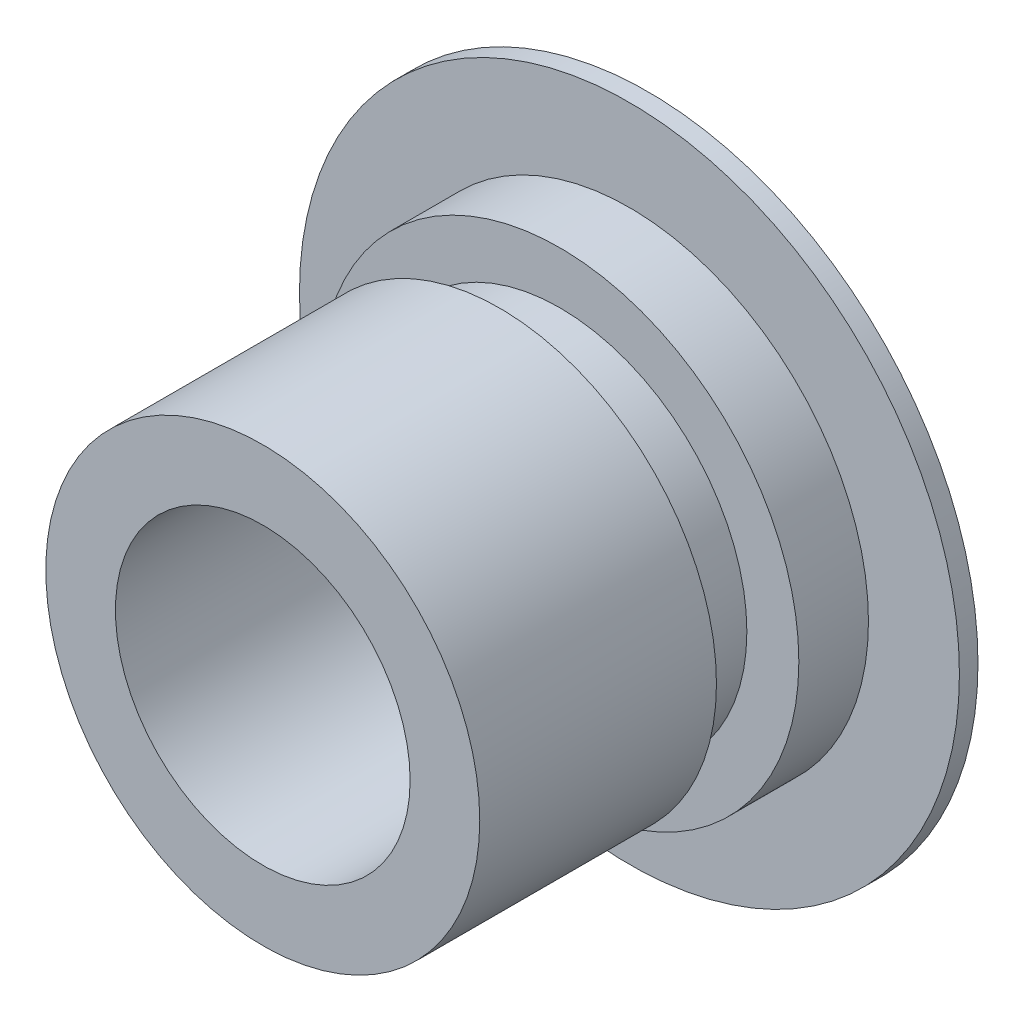
ISO-10303-21;
HEADER;
FILE_DESCRIPTION(('STEP AP214'),'2;1');
FILE_NAME('part.step','',(''),(''),'','','');
FILE_SCHEMA(('AUTOMOTIVE_DESIGN { 1 0 10303 214 1 1 1 1 }'));
ENDSEC;
DATA;
#1=APPLICATION_CONTEXT('core data for automotive mechanical design processes');
#2=APPLICATION_PROTOCOL_DEFINITION('international standard','automotive_design',2000,#1);
#3=PRODUCT_CONTEXT('',#1,'mechanical');
#4=PRODUCT('Part','Part','',(#3));
#5=PRODUCT_RELATED_PRODUCT_CATEGORY('part','',(#4));
#6=PRODUCT_DEFINITION_FORMATION('','',#4);
#7=PRODUCT_DEFINITION_CONTEXT('part definition',#1,'design');
#8=PRODUCT_DEFINITION('design','',#6,#7);
#9=PRODUCT_DEFINITION_SHAPE('','',#8);
#10=(LENGTH_UNIT() NAMED_UNIT(*) SI_UNIT(.MILLI.,.METRE.));
#11=(NAMED_UNIT(*) PLANE_ANGLE_UNIT() SI_UNIT($,.RADIAN.));
#12=(NAMED_UNIT(*) SI_UNIT($,.STERADIAN.) SOLID_ANGLE_UNIT());
#13=UNCERTAINTY_MEASURE_WITH_UNIT(LENGTH_MEASURE(1.E-05),#10,'distance_accuracy_value','');
#14=(GEOMETRIC_REPRESENTATION_CONTEXT(3) GLOBAL_UNCERTAINTY_ASSIGNED_CONTEXT((#13)) GLOBAL_UNIT_ASSIGNED_CONTEXT((#10,
#11,#12)) REPRESENTATION_CONTEXT('',''));
#15=CARTESIAN_POINT('',(0.,0.,0.));
#16=DIRECTION('',(0.,0.,1.));
#17=DIRECTION('',(1.,0.,0.));
#18=AXIS2_PLACEMENT_3D('',#15,#16,#17);
#19=CARTESIAN_POINT('',(0.,0.,0.));
#20=DIRECTION('',(0.,0.,-1.));
#21=DIRECTION('',(0.,-1.,0.));
#22=AXIS2_PLACEMENT_3D('',#19,#20,#21);
#23=PLANE('',#22);
#24=CARTESIAN_POINT('',(0.,0.,0.));
#25=DIRECTION('',(0.,0.,1.));
#26=DIRECTION('',(-1.,0.,0.));
#27=AXIS2_PLACEMENT_3D('',#24,#25,#26);
#28=CIRCLE('',#27,3.175);
#29=CARTESIAN_POINT('',(3.175,0.,0.));
#30=VERTEX_POINT('',#29);
#31=EDGE_CURVE('E68',#30,#30,#28,.T.);
#32=ORIENTED_EDGE('',*,*,#31,.T.);
#33=EDGE_LOOP('',(#32));
#34=FACE_BOUND('',#33,.T.);
#35=CARTESIAN_POINT('',(0.,0.,0.));
#36=DIRECTION('',(0.,0.,-1.));
#37=DIRECTION('',(-1.,0.,0.));
#38=AXIS2_PLACEMENT_3D('',#35,#36,#37);
#39=CIRCLE('',#38,7.11);
#40=CARTESIAN_POINT('',(7.11,0.,0.));
#41=VERTEX_POINT('',#40);
#42=EDGE_CURVE('E11',#41,#41,#39,.T.);
#43=ORIENTED_EDGE('',*,*,#42,.T.);
#44=EDGE_LOOP('',(#43));
#45=FACE_BOUND('',#44,.T.);
#46=ADVANCED_FACE('F16',(#34,#45),#23,.T.);
#47=CARTESIAN_POINT('',(0.,0.,0.4));
#48=DIRECTION('',(0.,0.,-1.));
#49=DIRECTION('',(0.,-1.,0.));
#50=AXIS2_PLACEMENT_3D('',#47,#48,#49);
#51=PLANE('',#50);
#52=CARTESIAN_POINT('',(0.,0.,0.4));
#53=DIRECTION('',(0.,0.,-1.));
#54=DIRECTION('',(-1.,0.,0.));
#55=AXIS2_PLACEMENT_3D('',#52,#53,#54);
#56=CIRCLE('',#55,5.15);
#57=CARTESIAN_POINT('',(5.15,0.,0.4));
#58=VERTEX_POINT('',#57);
#59=EDGE_CURVE('E84',#58,#58,#56,.T.);
#60=ORIENTED_EDGE('',*,*,#59,.T.);
#61=EDGE_LOOP('',(#60));
#62=FACE_BOUND('',#61,.T.);
#63=CARTESIAN_POINT('',(0.,0.,0.4));
#64=DIRECTION('',(0.,0.,-1.));
#65=DIRECTION('',(-1.,0.,0.));
#66=AXIS2_PLACEMENT_3D('',#63,#64,#65);
#67=CIRCLE('',#66,7.11);
#68=CARTESIAN_POINT('',(7.11,0.,0.4));
#69=VERTEX_POINT('',#68);
#70=EDGE_CURVE('E19',#69,#69,#67,.T.);
#71=ORIENTED_EDGE('',*,*,#70,.F.);
#72=EDGE_LOOP('',(#71));
#73=FACE_BOUND('',#72,.T.);
#74=ADVANCED_FACE('F126',(#62,#73),#51,.F.);
#75=CARTESIAN_POINT('',(0.,0.,0.));
#76=DIRECTION('',(0.,0.,1.));
#77=DIRECTION('',(-1.,0.,0.));
#78=AXIS2_PLACEMENT_3D('',#75,#76,#77);
#79=CYLINDRICAL_SURFACE('',#78,7.11);
#80=ORIENTED_EDGE('',*,*,#42,.F.);
#81=EDGE_LOOP('',(#80));
#82=FACE_BOUND('',#81,.T.);
#83=ORIENTED_EDGE('',*,*,#70,.T.);
#84=EDGE_LOOP('',(#83));
#85=FACE_BOUND('',#84,.T.);
#86=ADVANCED_FACE('F130',(#82,#85),#79,.T.);
#87=CARTESIAN_POINT('',(0.,0.,1.9));
#88=DIRECTION('',(0.,0.,-1.));
#89=DIRECTION('',(0.,-1.,0.));
#90=AXIS2_PLACEMENT_3D('',#87,#88,#89);
#91=PLANE('',#90);
#92=CARTESIAN_POINT('',(0.,0.,1.9));
#93=DIRECTION('',(0.,0.,-1.));
#94=DIRECTION('',(-1.,0.,0.));
#95=AXIS2_PLACEMENT_3D('',#92,#93,#94);
#96=CIRCLE('',#95,4.03);
#97=CARTESIAN_POINT('',(4.03,0.,1.9));
#98=VERTEX_POINT('',#97);
#99=EDGE_CURVE('E85',#98,#98,#96,.T.);
#100=ORIENTED_EDGE('',*,*,#99,.T.);
#101=EDGE_LOOP('',(#100));
#102=FACE_BOUND('',#101,.T.);
#103=CARTESIAN_POINT('',(0.,0.,1.9));
#104=DIRECTION('',(0.,0.,-1.));
#105=DIRECTION('',(-1.,0.,0.));
#106=AXIS2_PLACEMENT_3D('',#103,#104,#105);
#107=CIRCLE('',#106,5.15);
#108=CARTESIAN_POINT('',(5.15,0.,1.9));
#109=VERTEX_POINT('',#108);
#110=EDGE_CURVE('E82',#109,#109,#107,.T.);
#111=ORIENTED_EDGE('',*,*,#110,.F.);
#112=EDGE_LOOP('',(#111));
#113=FACE_BOUND('',#112,.T.);
#114=ADVANCED_FACE('F135',(#102,#113),#91,.F.);
#115=CARTESIAN_POINT('',(0.,0.,0.4));
#116=DIRECTION('',(0.,0.,1.));
#117=DIRECTION('',(-1.,0.,0.));
#118=AXIS2_PLACEMENT_3D('',#115,#116,#117);
#119=CYLINDRICAL_SURFACE('',#118,5.15);
#120=ORIENTED_EDGE('',*,*,#59,.F.);
#121=EDGE_LOOP('',(#120));
#122=FACE_BOUND('',#121,.T.);
#123=ORIENTED_EDGE('',*,*,#110,.T.);
#124=EDGE_LOOP('',(#123));
#125=FACE_BOUND('',#124,.T.);
#126=ADVANCED_FACE('F140',(#122,#125),#119,.T.);
#127=CARTESIAN_POINT('',(0.,0.,1.9));
#128=DIRECTION('',(0.,0.,1.));
#129=DIRECTION('',(-1.,0.,0.));
#130=AXIS2_PLACEMENT_3D('',#127,#128,#129);
#131=CYLINDRICAL_SURFACE('',#130,4.03);
#132=ORIENTED_EDGE('',*,*,#99,.F.);
#133=EDGE_LOOP('',(#132));
#134=FACE_BOUND('',#133,.T.);
#135=CARTESIAN_POINT('',(0.,0.,3.2));
#136=DIRECTION('',(0.,0.,-1.));
#137=DIRECTION('',(-1.,0.,0.));
#138=AXIS2_PLACEMENT_3D('',#135,#136,#137);
#139=CIRCLE('',#138,4.03);
#140=CARTESIAN_POINT('',(4.03,0.,3.2));
#141=VERTEX_POINT('',#140);
#142=EDGE_CURVE('E81',#141,#141,#139,.T.);
#143=ORIENTED_EDGE('',*,*,#142,.T.);
#144=EDGE_LOOP('',(#143));
#145=FACE_BOUND('',#144,.T.);
#146=ADVANCED_FACE('F104',(#134,#145),#131,.T.);
#147=CARTESIAN_POINT('',(0.,0.,8.3));
#148=DIRECTION('',(0.,0.,-1.));
#149=DIRECTION('',(0.,-1.,0.));
#150=AXIS2_PLACEMENT_3D('',#147,#148,#149);
#151=PLANE('',#150);
#152=CARTESIAN_POINT('',(0.,0.,8.3));
#153=DIRECTION('',(0.,0.,-1.));
#154=DIRECTION('',(-1.,0.,0.));
#155=AXIS2_PLACEMENT_3D('',#152,#153,#154);
#156=CIRCLE('',#155,3.175);
#157=CARTESIAN_POINT('',(3.175,0.,8.3));
#158=VERTEX_POINT('',#157);
#159=EDGE_CURVE('E71',#158,#158,#156,.T.);
#160=ORIENTED_EDGE('',*,*,#159,.T.);
#161=EDGE_LOOP('',(#160));
#162=FACE_BOUND('',#161,.T.);
#163=CARTESIAN_POINT('',(0.,0.,8.3));
#164=DIRECTION('',(0.,0.,-1.));
#165=DIRECTION('',(-1.,0.,0.));
#166=AXIS2_PLACEMENT_3D('',#163,#164,#165);
#167=CIRCLE('',#166,4.675);
#168=CARTESIAN_POINT('',(4.675,0.,8.3));
#169=VERTEX_POINT('',#168);
#170=EDGE_CURVE('E92',#169,#169,#167,.T.);
#171=ORIENTED_EDGE('',*,*,#170,.F.);
#172=EDGE_LOOP('',(#171));
#173=FACE_BOUND('',#172,.T.);
#174=ADVANCED_FACE('F115',(#162,#173),#151,.F.);
#175=CARTESIAN_POINT('',(0.,0.,3.2));
#176=DIRECTION('',(0.,0.,1.));
#177=DIRECTION('',(-1.,0.,0.));
#178=AXIS2_PLACEMENT_3D('',#175,#176,#177);
#179=CYLINDRICAL_SURFACE('',#178,4.675);
#180=CARTESIAN_POINT('',(0.,0.,3.2));
#181=DIRECTION('',(0.,0.,-1.));
#182=DIRECTION('',(-1.,0.,0.));
#183=AXIS2_PLACEMENT_3D('',#180,#181,#182);
#184=CIRCLE('',#183,4.675);
#185=CARTESIAN_POINT('',(4.675,0.,3.2));
#186=VERTEX_POINT('',#185);
#187=EDGE_CURVE('E77',#186,#186,#184,.T.);
#188=ORIENTED_EDGE('',*,*,#187,.F.);
#189=EDGE_LOOP('',(#188));
#190=FACE_BOUND('',#189,.T.);
#191=ORIENTED_EDGE('',*,*,#170,.T.);
#192=EDGE_LOOP('',(#191));
#193=FACE_BOUND('',#192,.T.);
#194=ADVANCED_FACE('F110',(#190,#193),#179,.T.);
#195=CARTESIAN_POINT('',(0.,0.,3.2));
#196=DIRECTION('',(0.,0.,-1.));
#197=DIRECTION('',(0.,-1.,0.));
#198=AXIS2_PLACEMENT_3D('',#195,#196,#197);
#199=PLANE('',#198);
#200=ORIENTED_EDGE('',*,*,#142,.F.);
#201=EDGE_LOOP('',(#200));
#202=FACE_BOUND('',#201,.T.);
#203=ORIENTED_EDGE('',*,*,#187,.T.);
#204=EDGE_LOOP('',(#203));
#205=FACE_BOUND('',#204,.T.);
#206=ADVANCED_FACE('F106',(#202,#205),#199,.T.);
#207=CARTESIAN_POINT('',(0.,0.,8.3));
#208=DIRECTION('',(0.,0.,-1.));
#209=DIRECTION('',(-1.,0.,0.));
#210=AXIS2_PLACEMENT_3D('',#207,#208,#209);
#211=CYLINDRICAL_SURFACE('',#210,3.175);
#212=ORIENTED_EDGE('',*,*,#159,.F.);
#213=EDGE_LOOP('',(#212));
#214=FACE_BOUND('',#213,.T.);
#215=ORIENTED_EDGE('',*,*,#31,.F.);
#216=EDGE_LOOP('',(#215));
#217=FACE_BOUND('',#216,.T.);
#218=ADVANCED_FACE('F109',(#214,#217),#211,.F.);
#219=CLOSED_SHELL('',(#46,#74,#86,#114,#126,#146,#174,#194,#206,#218));
#220=MANIFOLD_SOLID_BREP('B1',#219);
#221=ADVANCED_BREP_SHAPE_REPRESENTATION('',(#18,#220),#14);
#222=SHAPE_DEFINITION_REPRESENTATION(#9,#221);
ENDSEC;
END-ISO-10303-21;
